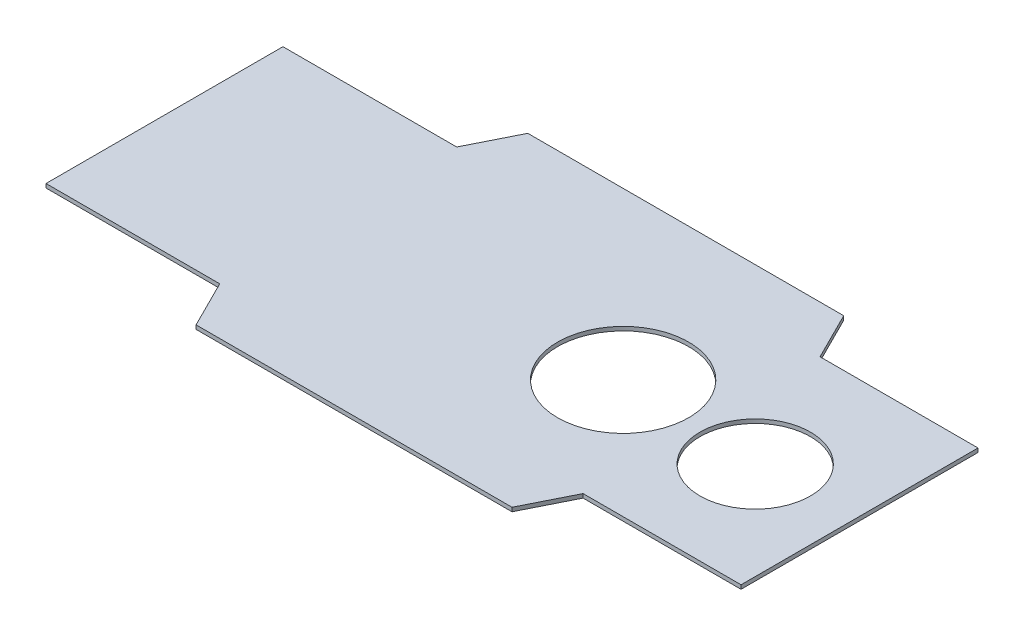
ISO-10303-21;
HEADER;
FILE_DESCRIPTION(('STEP AP214'),'2;1');
FILE_NAME('part.step','',(''),(''),'','','');
FILE_SCHEMA(('AUTOMOTIVE_DESIGN { 1 0 10303 214 1 1 1 1 }'));
ENDSEC;
DATA;
#1=APPLICATION_CONTEXT('core data for automotive mechanical design processes');
#2=APPLICATION_PROTOCOL_DEFINITION('international standard','automotive_design',2000,#1);
#3=PRODUCT_CONTEXT('',#1,'mechanical');
#4=PRODUCT('Part','Part','',(#3));
#5=PRODUCT_RELATED_PRODUCT_CATEGORY('part','',(#4));
#6=PRODUCT_DEFINITION_FORMATION('','',#4);
#7=PRODUCT_DEFINITION_CONTEXT('part definition',#1,'design');
#8=PRODUCT_DEFINITION('design','',#6,#7);
#9=PRODUCT_DEFINITION_SHAPE('','',#8);
#10=(LENGTH_UNIT() NAMED_UNIT(*) SI_UNIT(.MILLI.,.METRE.));
#11=(NAMED_UNIT(*) PLANE_ANGLE_UNIT() SI_UNIT($,.RADIAN.));
#12=(NAMED_UNIT(*) SI_UNIT($,.STERADIAN.) SOLID_ANGLE_UNIT());
#13=UNCERTAINTY_MEASURE_WITH_UNIT(LENGTH_MEASURE(1.E-05),#10,'distance_accuracy_value','');
#14=(GEOMETRIC_REPRESENTATION_CONTEXT(3) GLOBAL_UNCERTAINTY_ASSIGNED_CONTEXT((#13)) GLOBAL_UNIT_ASSIGNED_CONTEXT((#10,
#11,#12)) REPRESENTATION_CONTEXT('',''));
#15=CARTESIAN_POINT('',(0.,0.,0.));
#16=DIRECTION('',(0.,0.,1.));
#17=DIRECTION('',(1.,0.,0.));
#18=AXIS2_PLACEMENT_3D('',#15,#16,#17);
#19=CARTESIAN_POINT('',(279.4,1.5875,-95.25));
#20=DIRECTION('',(-1.,0.,0.));
#21=DIRECTION('',(0.,0.,1.));
#22=AXIS2_PLACEMENT_3D('',#19,#20,#21);
#23=PLANE('',#22);
#24=DIRECTION('',(0.,0.,-1.));
#25=VECTOR('',#24,1.);
#26=CARTESIAN_POINT('',(279.4,-1.5875,-95.25));
#27=LINE('',#26,#25);
#28=CARTESIAN_POINT('',(279.4,-1.5875,95.25));
#29=VERTEX_POINT('',#28);
#30=CARTESIAN_POINT('',(279.4,-1.5875,-95.25));
#31=VERTEX_POINT('',#30);
#32=EDGE_CURVE('E157',#29,#31,#27,.T.);
#33=ORIENTED_EDGE('',*,*,#32,.T.);
#34=DIRECTION('',(0.,-1.,0.));
#35=VECTOR('',#34,1.);
#36=CARTESIAN_POINT('',(279.4,1.5875,-95.25));
#37=LINE('',#36,#35);
#38=CARTESIAN_POINT('',(279.4,1.5875,-95.25));
#39=VERTEX_POINT('',#38);
#40=EDGE_CURVE('E11',#39,#31,#37,.T.);
#41=ORIENTED_EDGE('',*,*,#40,.F.);
#42=DIRECTION('',(0.,0.,-1.));
#43=VECTOR('',#42,1.);
#44=CARTESIAN_POINT('',(279.4,1.5875,-95.25));
#45=LINE('',#44,#43);
#46=CARTESIAN_POINT('',(279.4,1.5875,95.25));
#47=VERTEX_POINT('',#46);
#48=EDGE_CURVE('E179',#47,#39,#45,.T.);
#49=ORIENTED_EDGE('',*,*,#48,.F.);
#50=DIRECTION('',(0.,-1.,0.));
#51=VECTOR('',#50,1.);
#52=CARTESIAN_POINT('',(279.4,1.5875,95.25));
#53=LINE('',#52,#51);
#54=EDGE_CURVE('E153',#47,#29,#53,.T.);
#55=ORIENTED_EDGE('',*,*,#54,.T.);
#56=EDGE_LOOP('',(#33,#41,#49,#55));
#57=FACE_BOUND('',#56,.T.);
#58=ADVANCED_FACE('F35',(#57),#23,.F.);
#59=CARTESIAN_POINT('',(152.4,1.5875,-95.25));
#60=DIRECTION('',(0.,0.,1.));
#61=DIRECTION('',(1.,0.,0.));
#62=AXIS2_PLACEMENT_3D('',#59,#60,#61);
#63=PLANE('',#62);
#64=DIRECTION('',(-1.,0.,0.));
#65=VECTOR('',#64,1.);
#66=CARTESIAN_POINT('',(152.4,-1.5875,-95.25));
#67=LINE('',#66,#65);
#68=CARTESIAN_POINT('',(152.4,-1.5875,-95.25));
#69=VERTEX_POINT('',#68);
#70=EDGE_CURVE('E160',#31,#69,#67,.T.);
#71=ORIENTED_EDGE('',*,*,#70,.T.);
#72=DIRECTION('',(0.,-1.,0.));
#73=VECTOR('',#72,1.);
#74=CARTESIAN_POINT('',(152.4,1.5875,-95.25));
#75=LINE('',#74,#73);
#76=CARTESIAN_POINT('',(152.4,1.5875,-95.25));
#77=VERTEX_POINT('',#76);
#78=EDGE_CURVE('E44',#77,#69,#75,.T.);
#79=ORIENTED_EDGE('',*,*,#78,.F.);
#80=DIRECTION('',(-1.,0.,0.));
#81=VECTOR('',#80,1.);
#82=CARTESIAN_POINT('',(152.4,1.5875,-95.25));
#83=LINE('',#82,#81);
#84=EDGE_CURVE('E108',#39,#77,#83,.T.);
#85=ORIENTED_EDGE('',*,*,#84,.F.);
#86=ORIENTED_EDGE('',*,*,#40,.T.);
#87=EDGE_LOOP('',(#71,#79,#85,#86));
#88=FACE_BOUND('',#87,.T.);
#89=ADVANCED_FACE('F259',(#88),#63,.F.);
#90=CARTESIAN_POINT('',(133.35,1.5875,-133.35));
#91=DIRECTION('',(-0.894427190999916,0.,0.447213595499958));
#92=DIRECTION('',(0.447213595499958,0.,0.894427190999916));
#93=AXIS2_PLACEMENT_3D('',#90,#91,#92);
#94=PLANE('',#93);
#95=DIRECTION('',(-0.447213595499958,0.,-0.894427190999916));
#96=VECTOR('',#95,1.);
#97=CARTESIAN_POINT('',(133.35,-1.5875,-133.35));
#98=LINE('',#97,#96);
#99=CARTESIAN_POINT('',(133.35,-1.5875,-133.35));
#100=VERTEX_POINT('',#99);
#101=EDGE_CURVE('E162',#69,#100,#98,.T.);
#102=ORIENTED_EDGE('',*,*,#101,.T.);
#103=DIRECTION('',(0.,-1.,0.));
#104=VECTOR('',#103,1.);
#105=CARTESIAN_POINT('',(133.35,1.5875,-133.35));
#106=LINE('',#105,#104);
#107=CARTESIAN_POINT('',(133.35,1.5875,-133.35));
#108=VERTEX_POINT('',#107);
#109=EDGE_CURVE('E198',#108,#100,#106,.T.);
#110=ORIENTED_EDGE('',*,*,#109,.F.);
#111=DIRECTION('',(-0.447213595499958,0.,-0.894427190999916));
#112=VECTOR('',#111,1.);
#113=CARTESIAN_POINT('',(133.35,1.5875,-133.35));
#114=LINE('',#113,#112);
#115=EDGE_CURVE('E218',#77,#108,#114,.T.);
#116=ORIENTED_EDGE('',*,*,#115,.F.);
#117=ORIENTED_EDGE('',*,*,#78,.T.);
#118=EDGE_LOOP('',(#102,#110,#116,#117));
#119=FACE_BOUND('',#118,.T.);
#120=ADVANCED_FACE('F263',(#119),#94,.F.);
#121=CARTESIAN_POINT('',(-120.65,1.5875,-133.35));
#122=DIRECTION('',(0.,0.,1.));
#123=DIRECTION('',(1.,0.,0.));
#124=AXIS2_PLACEMENT_3D('',#121,#122,#123);
#125=PLANE('',#124);
#126=DIRECTION('',(-1.,0.,0.));
#127=VECTOR('',#126,1.);
#128=CARTESIAN_POINT('',(-120.65,-1.5875,-133.35));
#129=LINE('',#128,#127);
#130=CARTESIAN_POINT('',(-120.65,-1.5875,-133.35));
#131=VERTEX_POINT('',#130);
#132=EDGE_CURVE('E164',#100,#131,#129,.T.);
#133=ORIENTED_EDGE('',*,*,#132,.T.);
#134=DIRECTION('',(0.,-1.,0.));
#135=VECTOR('',#134,1.);
#136=CARTESIAN_POINT('',(-120.65,1.5875,-133.35));
#137=LINE('',#136,#135);
#138=CARTESIAN_POINT('',(-120.65,1.5875,-133.35));
#139=VERTEX_POINT('',#138);
#140=EDGE_CURVE('E195',#139,#131,#137,.T.);
#141=ORIENTED_EDGE('',*,*,#140,.F.);
#142=DIRECTION('',(-1.,0.,0.));
#143=VECTOR('',#142,1.);
#144=CARTESIAN_POINT('',(-120.65,1.5875,-133.35));
#145=LINE('',#144,#143);
#146=EDGE_CURVE('E220',#108,#139,#145,.T.);
#147=ORIENTED_EDGE('',*,*,#146,.F.);
#148=ORIENTED_EDGE('',*,*,#109,.T.);
#149=EDGE_LOOP('',(#133,#141,#147,#148));
#150=FACE_BOUND('',#149,.T.);
#151=ADVANCED_FACE('F267',(#150),#125,.F.);
#152=CARTESIAN_POINT('',(-139.7,1.5875,-95.25));
#153=DIRECTION('',(0.894427190999916,0.,0.447213595499958));
#154=DIRECTION('',(0.447213595499958,0.,-0.894427190999916));
#155=AXIS2_PLACEMENT_3D('',#152,#153,#154);
#156=PLANE('',#155);
#157=DIRECTION('',(-0.447213595499958,0.,0.894427190999916));
#158=VECTOR('',#157,1.);
#159=CARTESIAN_POINT('',(-139.7,-1.5875,-95.25));
#160=LINE('',#159,#158);
#161=CARTESIAN_POINT('',(-139.7,-1.5875,-95.25));
#162=VERTEX_POINT('',#161);
#163=EDGE_CURVE('E166',#131,#162,#160,.T.);
#164=ORIENTED_EDGE('',*,*,#163,.T.);
#165=DIRECTION('',(0.,-1.,0.));
#166=VECTOR('',#165,1.);
#167=CARTESIAN_POINT('',(-139.7,1.5875,-95.25));
#168=LINE('',#167,#166);
#169=CARTESIAN_POINT('',(-139.7,1.5875,-95.25));
#170=VERTEX_POINT('',#169);
#171=EDGE_CURVE('E192',#170,#162,#168,.T.);
#172=ORIENTED_EDGE('',*,*,#171,.F.);
#173=DIRECTION('',(-0.447213595499958,0.,0.894427190999916));
#174=VECTOR('',#173,1.);
#175=CARTESIAN_POINT('',(-139.7,1.5875,-95.25));
#176=LINE('',#175,#174);
#177=EDGE_CURVE('E222',#139,#170,#176,.T.);
#178=ORIENTED_EDGE('',*,*,#177,.F.);
#179=ORIENTED_EDGE('',*,*,#140,.T.);
#180=EDGE_LOOP('',(#164,#172,#178,#179));
#181=FACE_BOUND('',#180,.T.);
#182=ADVANCED_FACE('F273',(#181),#156,.F.);
#183=CARTESIAN_POINT('',(-279.4,1.5875,-95.25));
#184=DIRECTION('',(0.,0.,1.));
#185=DIRECTION('',(1.,0.,0.));
#186=AXIS2_PLACEMENT_3D('',#183,#184,#185);
#187=PLANE('',#186);
#188=DIRECTION('',(-1.,0.,0.));
#189=VECTOR('',#188,1.);
#190=CARTESIAN_POINT('',(-279.4,-1.5875,-95.25));
#191=LINE('',#190,#189);
#192=CARTESIAN_POINT('',(-279.4,-1.5875,-95.25));
#193=VERTEX_POINT('',#192);
#194=EDGE_CURVE('E168',#162,#193,#191,.T.);
#195=ORIENTED_EDGE('',*,*,#194,.T.);
#196=DIRECTION('',(0.,-1.,0.));
#197=VECTOR('',#196,1.);
#198=CARTESIAN_POINT('',(-279.4,1.5875,-95.25));
#199=LINE('',#198,#197);
#200=CARTESIAN_POINT('',(-279.4,1.5875,-95.25));
#201=VERTEX_POINT('',#200);
#202=EDGE_CURVE('E189',#201,#193,#199,.T.);
#203=ORIENTED_EDGE('',*,*,#202,.F.);
#204=DIRECTION('',(-1.,0.,0.));
#205=VECTOR('',#204,1.);
#206=CARTESIAN_POINT('',(-279.4,1.5875,-95.25));
#207=LINE('',#206,#205);
#208=EDGE_CURVE('E224',#170,#201,#207,.T.);
#209=ORIENTED_EDGE('',*,*,#208,.F.);
#210=ORIENTED_EDGE('',*,*,#171,.T.);
#211=EDGE_LOOP('',(#195,#203,#209,#210));
#212=FACE_BOUND('',#211,.T.);
#213=ADVANCED_FACE('F277',(#212),#187,.F.);
#214=CARTESIAN_POINT('',(-279.4,1.5875,-95.25));
#215=DIRECTION('',(1.,0.,0.));
#216=DIRECTION('',(0.,0.,-1.));
#217=AXIS2_PLACEMENT_3D('',#214,#215,#216);
#218=PLANE('',#217);
#219=DIRECTION('',(0.,0.,1.));
#220=VECTOR('',#219,1.);
#221=CARTESIAN_POINT('',(-279.4,-1.5875,-95.25));
#222=LINE('',#221,#220);
#223=CARTESIAN_POINT('',(-279.4,-1.5875,95.25));
#224=VERTEX_POINT('',#223);
#225=EDGE_CURVE('E170',#193,#224,#222,.T.);
#226=ORIENTED_EDGE('',*,*,#225,.T.);
#227=DIRECTION('',(0.,-1.,0.));
#228=VECTOR('',#227,1.);
#229=CARTESIAN_POINT('',(-279.4,1.5875,95.25));
#230=LINE('',#229,#228);
#231=CARTESIAN_POINT('',(-279.4,1.5875,95.25));
#232=VERTEX_POINT('',#231);
#233=EDGE_CURVE('E186',#232,#224,#230,.T.);
#234=ORIENTED_EDGE('',*,*,#233,.F.);
#235=DIRECTION('',(0.,0.,1.));
#236=VECTOR('',#235,1.);
#237=CARTESIAN_POINT('',(-279.4,1.5875,-95.25));
#238=LINE('',#237,#236);
#239=EDGE_CURVE('E226',#201,#232,#238,.T.);
#240=ORIENTED_EDGE('',*,*,#239,.F.);
#241=ORIENTED_EDGE('',*,*,#202,.T.);
#242=EDGE_LOOP('',(#226,#234,#240,#241));
#243=FACE_BOUND('',#242,.T.);
#244=ADVANCED_FACE('F281',(#243),#218,.F.);
#245=CARTESIAN_POINT('',(-279.4,1.5875,95.25));
#246=DIRECTION('',(0.,0.,-1.));
#247=DIRECTION('',(-1.,0.,0.));
#248=AXIS2_PLACEMENT_3D('',#245,#246,#247);
#249=PLANE('',#248);
#250=DIRECTION('',(1.,0.,0.));
#251=VECTOR('',#250,1.);
#252=CARTESIAN_POINT('',(-279.4,-1.5875,95.25));
#253=LINE('',#252,#251);
#254=CARTESIAN_POINT('',(-139.7,-1.5875,95.25));
#255=VERTEX_POINT('',#254);
#256=EDGE_CURVE('E172',#224,#255,#253,.T.);
#257=ORIENTED_EDGE('',*,*,#256,.T.);
#258=DIRECTION('',(0.,-1.,0.));
#259=VECTOR('',#258,1.);
#260=CARTESIAN_POINT('',(-139.7,1.5875,95.25));
#261=LINE('',#260,#259);
#262=CARTESIAN_POINT('',(-139.7,1.5875,95.25));
#263=VERTEX_POINT('',#262);
#264=EDGE_CURVE('E183',#263,#255,#261,.T.);
#265=ORIENTED_EDGE('',*,*,#264,.F.);
#266=DIRECTION('',(1.,0.,0.));
#267=VECTOR('',#266,1.);
#268=CARTESIAN_POINT('',(-279.4,1.5875,95.25));
#269=LINE('',#268,#267);
#270=EDGE_CURVE('E228',#232,#263,#269,.T.);
#271=ORIENTED_EDGE('',*,*,#270,.F.);
#272=ORIENTED_EDGE('',*,*,#233,.T.);
#273=EDGE_LOOP('',(#257,#265,#271,#272));
#274=FACE_BOUND('',#273,.T.);
#275=ADVANCED_FACE('F234',(#274),#249,.F.);
#276=CARTESIAN_POINT('',(-139.7,1.5875,95.25));
#277=DIRECTION('',(0.894427190999916,0.,-0.447213595499958));
#278=DIRECTION('',(-0.447213595499958,0.,-0.894427190999916));
#279=AXIS2_PLACEMENT_3D('',#276,#277,#278);
#280=PLANE('',#279);
#281=DIRECTION('',(0.447213595499958,0.,0.894427190999916));
#282=VECTOR('',#281,1.);
#283=CARTESIAN_POINT('',(-139.7,-1.5875,95.25));
#284=LINE('',#283,#282);
#285=CARTESIAN_POINT('',(-120.65,-1.5875,133.35));
#286=VERTEX_POINT('',#285);
#287=EDGE_CURVE('E174',#255,#286,#284,.T.);
#288=ORIENTED_EDGE('',*,*,#287,.T.);
#289=DIRECTION('',(0.,-1.,0.));
#290=VECTOR('',#289,1.);
#291=CARTESIAN_POINT('',(-120.65,1.5875,133.35));
#292=LINE('',#291,#290);
#293=CARTESIAN_POINT('',(-120.65,1.5875,133.35));
#294=VERTEX_POINT('',#293);
#295=EDGE_CURVE('E148',#294,#286,#292,.T.);
#296=ORIENTED_EDGE('',*,*,#295,.F.);
#297=DIRECTION('',(0.447213595499958,0.,0.894427190999916));
#298=VECTOR('',#297,1.);
#299=CARTESIAN_POINT('',(-139.7,1.5875,95.25));
#300=LINE('',#299,#298);
#301=EDGE_CURVE('E139',#263,#294,#300,.T.);
#302=ORIENTED_EDGE('',*,*,#301,.F.);
#303=ORIENTED_EDGE('',*,*,#264,.T.);
#304=EDGE_LOOP('',(#288,#296,#302,#303));
#305=FACE_BOUND('',#304,.T.);
#306=ADVANCED_FACE('F238',(#305),#280,.F.);
#307=CARTESIAN_POINT('',(-120.65,1.5875,133.35));
#308=DIRECTION('',(0.,0.,-1.));
#309=DIRECTION('',(-1.,0.,0.));
#310=AXIS2_PLACEMENT_3D('',#307,#308,#309);
#311=PLANE('',#310);
#312=DIRECTION('',(1.,0.,0.));
#313=VECTOR('',#312,1.);
#314=CARTESIAN_POINT('',(-120.65,-1.5875,133.35));
#315=LINE('',#314,#313);
#316=CARTESIAN_POINT('',(133.35,-1.5875,133.35));
#317=VERTEX_POINT('',#316);
#318=EDGE_CURVE('E147',#286,#317,#315,.T.);
#319=ORIENTED_EDGE('',*,*,#318,.T.);
#320=DIRECTION('',(0.,-1.,0.));
#321=VECTOR('',#320,1.);
#322=CARTESIAN_POINT('',(133.35,1.5875,133.35));
#323=LINE('',#322,#321);
#324=CARTESIAN_POINT('',(133.35,1.5875,133.35));
#325=VERTEX_POINT('',#324);
#326=EDGE_CURVE('E144',#325,#317,#323,.T.);
#327=ORIENTED_EDGE('',*,*,#326,.F.);
#328=DIRECTION('',(1.,0.,0.));
#329=VECTOR('',#328,1.);
#330=CARTESIAN_POINT('',(-120.65,1.5875,133.35));
#331=LINE('',#330,#329);
#332=EDGE_CURVE('E133',#294,#325,#331,.T.);
#333=ORIENTED_EDGE('',*,*,#332,.F.);
#334=ORIENTED_EDGE('',*,*,#295,.T.);
#335=EDGE_LOOP('',(#319,#327,#333,#334));
#336=FACE_BOUND('',#335,.T.);
#337=ADVANCED_FACE('F145',(#336),#311,.F.);
#338=CARTESIAN_POINT('',(133.35,1.5875,133.35));
#339=DIRECTION('',(-0.894427190999916,0.,-0.447213595499958));
#340=DIRECTION('',(-0.447213595499958,0.,0.894427190999916));
#341=AXIS2_PLACEMENT_3D('',#338,#339,#340);
#342=PLANE('',#341);
#343=DIRECTION('',(0.447213595499958,0.,-0.894427190999916));
#344=VECTOR('',#343,1.);
#345=CARTESIAN_POINT('',(133.35,-1.5875,133.35));
#346=LINE('',#345,#344);
#347=CARTESIAN_POINT('',(152.4,-1.5875,95.25));
#348=VERTEX_POINT('',#347);
#349=EDGE_CURVE('E94',#317,#348,#346,.T.);
#350=ORIENTED_EDGE('',*,*,#349,.T.);
#351=DIRECTION('',(0.,-1.,0.));
#352=VECTOR('',#351,1.);
#353=CARTESIAN_POINT('',(152.4,1.5875,95.25));
#354=LINE('',#353,#352);
#355=CARTESIAN_POINT('',(152.4,1.5875,95.25));
#356=VERTEX_POINT('',#355);
#357=EDGE_CURVE('E149',#356,#348,#354,.T.);
#358=ORIENTED_EDGE('',*,*,#357,.F.);
#359=DIRECTION('',(0.447213595499958,0.,-0.894427190999916));
#360=VECTOR('',#359,1.);
#361=CARTESIAN_POINT('',(133.35,1.5875,133.35));
#362=LINE('',#361,#360);
#363=EDGE_CURVE('E137',#325,#356,#362,.T.);
#364=ORIENTED_EDGE('',*,*,#363,.F.);
#365=ORIENTED_EDGE('',*,*,#326,.T.);
#366=EDGE_LOOP('',(#350,#358,#364,#365));
#367=FACE_BOUND('',#366,.T.);
#368=ADVANCED_FACE('F151',(#367),#342,.F.);
#369=CARTESIAN_POINT('',(152.4,1.5875,95.25));
#370=DIRECTION('',(0.,0.,-1.));
#371=DIRECTION('',(-1.,0.,0.));
#372=AXIS2_PLACEMENT_3D('',#369,#370,#371);
#373=PLANE('',#372);
#374=DIRECTION('',(1.,0.,0.));
#375=VECTOR('',#374,1.);
#376=CARTESIAN_POINT('',(152.4,-1.5875,95.25));
#377=LINE('',#376,#375);
#378=EDGE_CURVE('E100',#348,#29,#377,.T.);
#379=ORIENTED_EDGE('',*,*,#378,.T.);
#380=ORIENTED_EDGE('',*,*,#54,.F.);
#381=DIRECTION('',(1.,0.,0.));
#382=VECTOR('',#381,1.);
#383=CARTESIAN_POINT('',(152.4,1.5875,95.25));
#384=LINE('',#383,#382);
#385=EDGE_CURVE('E53',#356,#47,#384,.T.);
#386=ORIENTED_EDGE('',*,*,#385,.F.);
#387=ORIENTED_EDGE('',*,*,#357,.T.);
#388=EDGE_LOOP('',(#379,#380,#386,#387));
#389=FACE_BOUND('',#388,.T.);
#390=ADVANCED_FACE('F246',(#389),#373,.F.);
#391=CARTESIAN_POINT('',(0.,1.5875,0.));
#392=DIRECTION('',(0.,1.,0.));
#393=DIRECTION('',(0.,0.,1.));
#394=AXIS2_PLACEMENT_3D('',#391,#392,#393);
#395=PLANE('',#394);
#396=CARTESIAN_POINT('',(201.029841253188,1.5875,5.4935825101217));
#397=DIRECTION('',(0.,1.,0.));
#398=DIRECTION('',(0.,0.,1.));
#399=AXIS2_PLACEMENT_3D('',#396,#397,#398);
#400=CIRCLE('',#399,44.45);
#401=CARTESIAN_POINT('',(201.029841253188,1.5875,49.9435825101217));
#402=VERTEX_POINT('',#401);
#403=EDGE_CURVE('E204',#402,#402,#400,.T.);
#404=ORIENTED_EDGE('',*,*,#403,.F.);
#405=EDGE_LOOP('',(#404));
#406=FACE_BOUND('',#405,.T.);
#407=CARTESIAN_POINT('',(89.3496016843557,1.5875,0.));
#408=DIRECTION('',(0.,1.,0.));
#409=DIRECTION('',(0.,0.,1.));
#410=AXIS2_PLACEMENT_3D('',#407,#408,#409);
#411=CIRCLE('',#410,52.705);
#412=CARTESIAN_POINT('',(89.3496016843557,1.5875,52.705));
#413=VERTEX_POINT('',#412);
#414=EDGE_CURVE('E209',#413,#413,#411,.T.);
#415=ORIENTED_EDGE('',*,*,#414,.F.);
#416=EDGE_LOOP('',(#415));
#417=FACE_BOUND('',#416,.T.);
#418=ORIENTED_EDGE('',*,*,#48,.T.);
#419=ORIENTED_EDGE('',*,*,#84,.T.);
#420=ORIENTED_EDGE('',*,*,#115,.T.);
#421=ORIENTED_EDGE('',*,*,#146,.T.);
#422=ORIENTED_EDGE('',*,*,#177,.T.);
#423=ORIENTED_EDGE('',*,*,#208,.T.);
#424=ORIENTED_EDGE('',*,*,#239,.T.);
#425=ORIENTED_EDGE('',*,*,#270,.T.);
#426=ORIENTED_EDGE('',*,*,#301,.T.);
#427=ORIENTED_EDGE('',*,*,#332,.T.);
#428=ORIENTED_EDGE('',*,*,#363,.T.);
#429=ORIENTED_EDGE('',*,*,#385,.T.);
#430=EDGE_LOOP('',(#418,#419,#420,#421,#422,#423,#424,#425,#426,#427,#428,#429));
#431=FACE_BOUND('',#430,.T.);
#432=ADVANCED_FACE('F135',(#406,#417,#431),#395,.T.);
#433=CARTESIAN_POINT('',(0.,-1.5875,0.));
#434=DIRECTION('',(0.,1.,0.));
#435=DIRECTION('',(0.,0.,1.));
#436=AXIS2_PLACEMENT_3D('',#433,#434,#435);
#437=PLANE('',#436);
#438=CARTESIAN_POINT('',(201.029841253188,-1.5875,5.4935825101217));
#439=DIRECTION('',(0.,1.,0.));
#440=DIRECTION('',(0.,0.,1.));
#441=AXIS2_PLACEMENT_3D('',#438,#439,#440);
#442=CIRCLE('',#441,44.45);
#443=CARTESIAN_POINT('',(201.029841253188,-1.5875,49.9435825101217));
#444=VERTEX_POINT('',#443);
#445=EDGE_CURVE('E38',#444,#444,#442,.T.);
#446=ORIENTED_EDGE('',*,*,#445,.T.);
#447=EDGE_LOOP('',(#446));
#448=FACE_BOUND('',#447,.T.);
#449=CARTESIAN_POINT('',(89.3496016843557,-1.5875,0.));
#450=DIRECTION('',(0.,1.,0.));
#451=DIRECTION('',(0.,0.,1.));
#452=AXIS2_PLACEMENT_3D('',#449,#450,#451);
#453=CIRCLE('',#452,52.705);
#454=CARTESIAN_POINT('',(89.3496016843557,-1.5875,52.705));
#455=VERTEX_POINT('',#454);
#456=EDGE_CURVE('E202',#455,#455,#453,.T.);
#457=ORIENTED_EDGE('',*,*,#456,.T.);
#458=EDGE_LOOP('',(#457));
#459=FACE_BOUND('',#458,.T.);
#460=ORIENTED_EDGE('',*,*,#32,.F.);
#461=ORIENTED_EDGE('',*,*,#378,.F.);
#462=ORIENTED_EDGE('',*,*,#349,.F.);
#463=ORIENTED_EDGE('',*,*,#318,.F.);
#464=ORIENTED_EDGE('',*,*,#287,.F.);
#465=ORIENTED_EDGE('',*,*,#256,.F.);
#466=ORIENTED_EDGE('',*,*,#225,.F.);
#467=ORIENTED_EDGE('',*,*,#194,.F.);
#468=ORIENTED_EDGE('',*,*,#163,.F.);
#469=ORIENTED_EDGE('',*,*,#132,.F.);
#470=ORIENTED_EDGE('',*,*,#101,.F.);
#471=ORIENTED_EDGE('',*,*,#70,.F.);
#472=EDGE_LOOP('',(#460,#461,#462,#463,#464,#465,#466,#467,#468,#469,#470,#471));
#473=FACE_BOUND('',#472,.T.);
#474=ADVANCED_FACE('F241',(#448,#459,#473),#437,.F.);
#475=CARTESIAN_POINT('',(89.3496016843557,-18.7325,0.));
#476=DIRECTION('',(0.,1.,0.));
#477=DIRECTION('',(0.,0.,1.));
#478=AXIS2_PLACEMENT_3D('',#475,#476,#477);
#479=CYLINDRICAL_SURFACE('',#478,52.705);
#480=ORIENTED_EDGE('',*,*,#414,.T.);
#481=EDGE_LOOP('',(#480));
#482=FACE_BOUND('',#481,.T.);
#483=ORIENTED_EDGE('',*,*,#456,.F.);
#484=EDGE_LOOP('',(#483));
#485=FACE_BOUND('',#484,.T.);
#486=ADVANCED_FACE('F314',(#482,#485),#479,.F.);
#487=CARTESIAN_POINT('',(201.029841253188,-18.7325,5.4935825101217));
#488=DIRECTION('',(0.,1.,0.));
#489=DIRECTION('',(0.,0.,1.));
#490=AXIS2_PLACEMENT_3D('',#487,#488,#489);
#491=CYLINDRICAL_SURFACE('',#490,44.45);
#492=ORIENTED_EDGE('',*,*,#403,.T.);
#493=EDGE_LOOP('',(#492));
#494=FACE_BOUND('',#493,.T.);
#495=ORIENTED_EDGE('',*,*,#445,.F.);
#496=EDGE_LOOP('',(#495));
#497=FACE_BOUND('',#496,.T.);
#498=ADVANCED_FACE('F322',(#494,#497),#491,.F.);
#499=CLOSED_SHELL('',(#58,#89,#120,#151,#182,#213,#244,#275,#306,#337,#368,#390,#432,#474,#486,#498));
#500=MANIFOLD_SOLID_BREP('B2',#499);
#501=ADVANCED_BREP_SHAPE_REPRESENTATION('',(#18,#500),#14);
#502=SHAPE_DEFINITION_REPRESENTATION(#9,#501);
ENDSEC;
END-ISO-10303-21;
